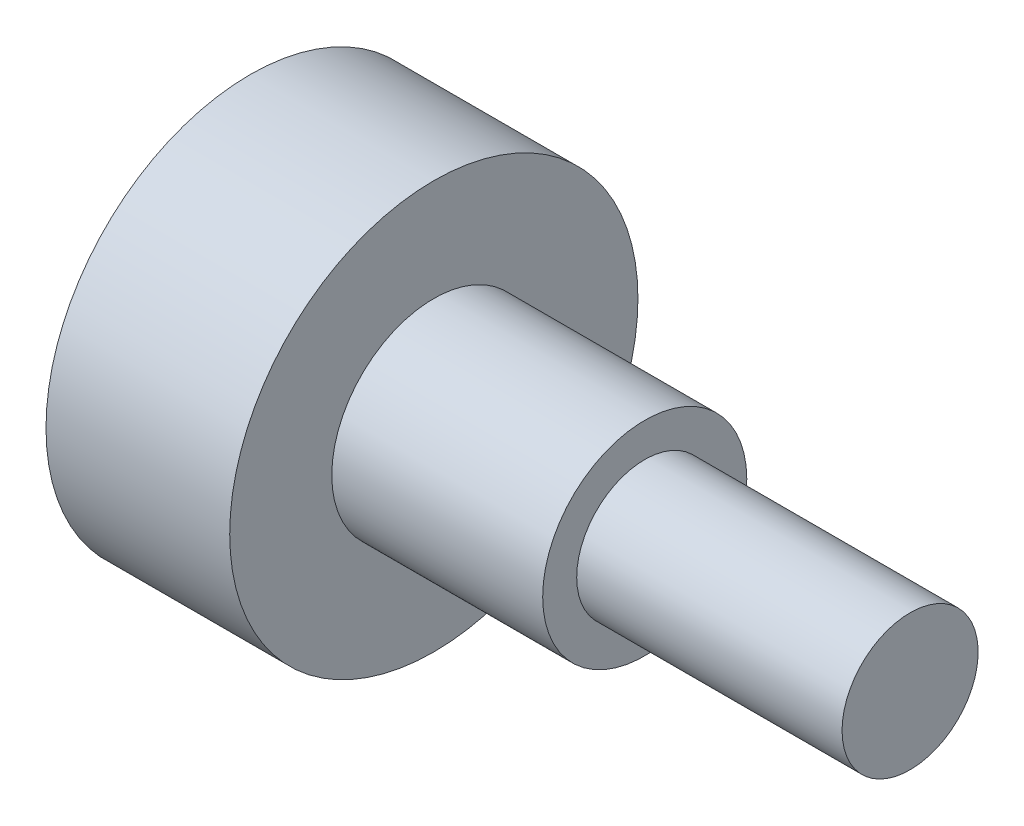
ISO-10303-21;
HEADER;
FILE_DESCRIPTION(('STEP AP214'),'2;1');
FILE_NAME('part.step','',(''),(''),'','','');
FILE_SCHEMA(('AUTOMOTIVE_DESIGN { 1 0 10303 214 1 1 1 1 }'));
ENDSEC;
DATA;
#1=APPLICATION_CONTEXT('core data for automotive mechanical design processes');
#2=APPLICATION_PROTOCOL_DEFINITION('international standard','automotive_design',2000,#1);
#3=PRODUCT_CONTEXT('',#1,'mechanical');
#4=PRODUCT('Part','Part','',(#3));
#5=PRODUCT_RELATED_PRODUCT_CATEGORY('part','',(#4));
#6=PRODUCT_DEFINITION_FORMATION('','',#4);
#7=PRODUCT_DEFINITION_CONTEXT('part definition',#1,'design');
#8=PRODUCT_DEFINITION('design','',#6,#7);
#9=PRODUCT_DEFINITION_SHAPE('','',#8);
#10=(LENGTH_UNIT() NAMED_UNIT(*) SI_UNIT(.MILLI.,.METRE.));
#11=(NAMED_UNIT(*) PLANE_ANGLE_UNIT() SI_UNIT($,.RADIAN.));
#12=(NAMED_UNIT(*) SI_UNIT($,.STERADIAN.) SOLID_ANGLE_UNIT());
#13=UNCERTAINTY_MEASURE_WITH_UNIT(LENGTH_MEASURE(1.E-05),#10,'distance_accuracy_value','');
#14=(GEOMETRIC_REPRESENTATION_CONTEXT(3) GLOBAL_UNCERTAINTY_ASSIGNED_CONTEXT((#13)) GLOBAL_UNIT_ASSIGNED_CONTEXT((#10,
#11,#12)) REPRESENTATION_CONTEXT('',''));
#15=CARTESIAN_POINT('',(0.,0.,0.));
#16=DIRECTION('',(0.,0.,1.));
#17=DIRECTION('',(1.,0.,0.));
#18=AXIS2_PLACEMENT_3D('',#15,#16,#17);
#19=CARTESIAN_POINT('',(0.,2.,0.));
#20=DIRECTION('',(-1.,0.,0.));
#21=DIRECTION('',(0.,0.,1.));
#22=AXIS2_PLACEMENT_3D('',#19,#20,#21);
#23=PLANE('',#22);
#24=CARTESIAN_POINT('',(0.,0.,0.));
#25=DIRECTION('',(-1.,0.,0.));
#26=DIRECTION('',(0.,0.,1.));
#27=AXIS2_PLACEMENT_3D('',#24,#25,#26);
#28=CIRCLE('',#27,1.5);
#29=CARTESIAN_POINT('',(0.,0.,1.5));
#30=VERTEX_POINT('',#29);
#31=EDGE_CURVE('E126',#30,#30,#28,.T.);
#32=ORIENTED_EDGE('',*,*,#31,.T.);
#33=EDGE_LOOP('',(#32));
#34=FACE_BOUND('',#33,.T.);
#35=CARTESIAN_POINT('',(0.,0.,0.));
#36=DIRECTION('',(-1.,0.,0.));
#37=DIRECTION('',(0.,0.,1.));
#38=AXIS2_PLACEMENT_3D('',#35,#36,#37);
#39=CIRCLE('',#38,3.);
#40=CARTESIAN_POINT('',(0.,0.,3.));
#41=VERTEX_POINT('',#40);
#42=EDGE_CURVE('E146',#41,#41,#39,.T.);
#43=ORIENTED_EDGE('',*,*,#42,.F.);
#44=EDGE_LOOP('',(#43));
#45=FACE_BOUND('',#44,.T.);
#46=ADVANCED_FACE('F32',(#34,#45),#23,.F.);
#47=CARTESIAN_POINT('',(-0.757628827681368,0.,0.));
#48=DIRECTION('',(-1.,0.,0.));
#49=DIRECTION('',(0.,0.,1.));
#50=AXIS2_PLACEMENT_3D('',#47,#48,#49);
#51=CYLINDRICAL_SURFACE('',#50,1.5);
#52=ORIENTED_EDGE('',*,*,#31,.F.);
#53=EDGE_LOOP('',(#52));
#54=FACE_BOUND('',#53,.T.);
#55=CARTESIAN_POINT('',(3.1,0.,0.));
#56=DIRECTION('',(-1.,0.,0.));
#57=DIRECTION('',(0.,0.,1.));
#58=AXIS2_PLACEMENT_3D('',#55,#56,#57);
#59=CIRCLE('',#58,1.5);
#60=CARTESIAN_POINT('',(3.1,0.,1.5));
#61=VERTEX_POINT('',#60);
#62=EDGE_CURVE('E91',#61,#61,#59,.T.);
#63=ORIENTED_EDGE('',*,*,#62,.T.);
#64=EDGE_LOOP('',(#63));
#65=FACE_BOUND('',#64,.T.);
#66=ADVANCED_FACE('F154',(#54,#65),#51,.T.);
#67=CARTESIAN_POINT('',(0.,0.,0.));
#68=DIRECTION('',(-1.,0.,0.));
#69=DIRECTION('',(0.,0.,1.));
#70=AXIS2_PLACEMENT_3D('',#67,#68,#69);
#71=CYLINDRICAL_SURFACE('',#70,1.);
#72=CARTESIAN_POINT('',(7.,0.,0.));
#73=DIRECTION('',(-1.,0.,0.));
#74=DIRECTION('',(0.,0.,1.));
#75=AXIS2_PLACEMENT_3D('',#72,#73,#74);
#76=CIRCLE('',#75,1.);
#77=CARTESIAN_POINT('',(7.,0.,1.));
#78=VERTEX_POINT('',#77);
#79=EDGE_CURVE('E129',#78,#78,#76,.T.);
#80=ORIENTED_EDGE('',*,*,#79,.T.);
#81=EDGE_LOOP('',(#80));
#82=FACE_BOUND('',#81,.T.);
#83=CARTESIAN_POINT('',(3.1,0.,0.));
#84=DIRECTION('',(-1.,0.,0.));
#85=DIRECTION('',(0.,0.,1.));
#86=AXIS2_PLACEMENT_3D('',#83,#84,#85);
#87=CIRCLE('',#86,0.999999999999999);
#88=CARTESIAN_POINT('',(3.1,0.,0.999999999999999));
#89=VERTEX_POINT('',#88);
#90=EDGE_CURVE('E132',#89,#89,#87,.T.);
#91=ORIENTED_EDGE('',*,*,#90,.F.);
#92=EDGE_LOOP('',(#91));
#93=FACE_BOUND('',#92,.T.);
#94=ADVANCED_FACE('F159',(#82,#93),#71,.T.);
#95=CARTESIAN_POINT('',(3.1,1.5,0.));
#96=DIRECTION('',(1.,0.,0.));
#97=DIRECTION('',(0.,0.,-1.));
#98=AXIS2_PLACEMENT_3D('',#95,#96,#97);
#99=PLANE('',#98);
#100=ORIENTED_EDGE('',*,*,#90,.T.);
#101=EDGE_LOOP('',(#100));
#102=FACE_BOUND('',#101,.T.);
#103=ORIENTED_EDGE('',*,*,#62,.F.);
#104=EDGE_LOOP('',(#103));
#105=FACE_BOUND('',#104,.T.);
#106=ADVANCED_FACE('F166',(#102,#105),#99,.T.);
#107=CARTESIAN_POINT('',(7.,0.,0.));
#108=DIRECTION('',(-1.,0.,0.));
#109=DIRECTION('',(0.,0.,1.));
#110=AXIS2_PLACEMENT_3D('',#107,#108,#109);
#111=PLANE('',#110);
#112=ORIENTED_EDGE('',*,*,#79,.F.);
#113=EDGE_LOOP('',(#112));
#114=FACE_BOUND('',#113,.T.);
#115=ADVANCED_FACE('F168',(#114),#111,.F.);
#116=CARTESIAN_POINT('',(-2.7,3.,0.));
#117=DIRECTION('',(-1.,0.,0.));
#118=DIRECTION('',(0.,0.,1.));
#119=AXIS2_PLACEMENT_3D('',#116,#117,#118);
#120=PLANE('',#119);
#121=CARTESIAN_POINT('',(-2.7,0.,0.));
#122=DIRECTION('',(-1.,0.,0.));
#123=DIRECTION('',(0.,0.,1.));
#124=AXIS2_PLACEMENT_3D('',#121,#122,#123);
#125=CIRCLE('',#124,3.);
#126=CARTESIAN_POINT('',(-2.7,0.,3.));
#127=VERTEX_POINT('',#126);
#128=EDGE_CURVE('E143',#127,#127,#125,.T.);
#129=ORIENTED_EDGE('',*,*,#128,.T.);
#130=EDGE_LOOP('',(#129));
#131=FACE_BOUND('',#130,.T.);
#132=DIRECTION('',(0.,-0.5,0.866025403784439));
#133=VECTOR('',#132,1.);
#134=CARTESIAN_POINT('',(-2.7,0.86602540378444,1.5));
#135=LINE('',#134,#133);
#136=CARTESIAN_POINT('',(-2.7,1.73205080756888,0.));
#137=VERTEX_POINT('',#136);
#138=CARTESIAN_POINT('',(-2.7,0.86602540378444,1.5));
#139=VERTEX_POINT('',#138);
#140=EDGE_CURVE('E83',#137,#139,#135,.T.);
#141=ORIENTED_EDGE('',*,*,#140,.T.);
#142=DIRECTION('',(0.,-1.,0.));
#143=VECTOR('',#142,1.);
#144=CARTESIAN_POINT('',(-2.7,-0.866025403784439,1.5));
#145=LINE('',#144,#143);
#146=CARTESIAN_POINT('',(-2.7,-0.866025403784439,1.5));
#147=VERTEX_POINT('',#146);
#148=EDGE_CURVE('E92',#139,#147,#145,.T.);
#149=ORIENTED_EDGE('',*,*,#148,.T.);
#150=DIRECTION('',(0.,-0.5,-0.866025403784438));
#151=VECTOR('',#150,1.);
#152=CARTESIAN_POINT('',(-2.7,-1.73205080756888,0.));
#153=LINE('',#152,#151);
#154=CARTESIAN_POINT('',(-2.7,-1.73205080756888,0.));
#155=VERTEX_POINT('',#154);
#156=EDGE_CURVE('E138',#147,#155,#153,.T.);
#157=ORIENTED_EDGE('',*,*,#156,.T.);
#158=DIRECTION('',(0.,0.5,-0.866025403784439));
#159=VECTOR('',#158,1.);
#160=CARTESIAN_POINT('',(-2.7,-0.866025403784439,-1.5));
#161=LINE('',#160,#159);
#162=CARTESIAN_POINT('',(-2.7,-0.866025403784439,-1.5));
#163=VERTEX_POINT('',#162);
#164=EDGE_CURVE('E140',#155,#163,#161,.T.);
#165=ORIENTED_EDGE('',*,*,#164,.T.);
#166=DIRECTION('',(0.,1.,0.));
#167=VECTOR('',#166,1.);
#168=CARTESIAN_POINT('',(-2.7,0.866025403784439,-1.5));
#169=LINE('',#168,#167);
#170=CARTESIAN_POINT('',(-2.7,0.866025403784439,-1.5));
#171=VERTEX_POINT('',#170);
#172=EDGE_CURVE('E45',#163,#171,#169,.T.);
#173=ORIENTED_EDGE('',*,*,#172,.T.);
#174=DIRECTION('',(0.,0.5,0.866025403784439));
#175=VECTOR('',#174,1.);
#176=CARTESIAN_POINT('',(-2.7,1.73205080756888,0.));
#177=LINE('',#176,#175);
#178=EDGE_CURVE('E11',#171,#137,#177,.T.);
#179=ORIENTED_EDGE('',*,*,#178,.T.);
#180=EDGE_LOOP('',(#141,#149,#157,#165,#173,#179));
#181=FACE_BOUND('',#180,.T.);
#182=ADVANCED_FACE('F82',(#131,#181),#120,.T.);
#183=CARTESIAN_POINT('',(-4.40563250720869,0.,0.));
#184=DIRECTION('',(-1.,0.,0.));
#185=DIRECTION('',(0.,0.,1.));
#186=AXIS2_PLACEMENT_3D('',#183,#184,#185);
#187=CYLINDRICAL_SURFACE('',#186,3.);
#188=ORIENTED_EDGE('',*,*,#42,.T.);
#189=EDGE_LOOP('',(#188));
#190=FACE_BOUND('',#189,.T.);
#191=ORIENTED_EDGE('',*,*,#128,.F.);
#192=EDGE_LOOP('',(#191));
#193=FACE_BOUND('',#192,.T.);
#194=ADVANCED_FACE('F150',(#190,#193),#187,.T.);
#195=CARTESIAN_POINT('',(-1.3,2.59807621135332,-1.5));
#196=DIRECTION('',(-1.,0.,0.));
#197=DIRECTION('',(0.,0.,1.));
#198=AXIS2_PLACEMENT_3D('',#195,#196,#197);
#199=PLANE('',#198);
#200=DIRECTION('',(0.,0.5,-0.866025403784439));
#201=VECTOR('',#200,1.);
#202=CARTESIAN_POINT('',(-1.3,0.86602540378444,1.5));
#203=LINE('',#202,#201);
#204=CARTESIAN_POINT('',(-1.3,0.86602540378444,1.5));
#205=VERTEX_POINT('',#204);
#206=CARTESIAN_POINT('',(-1.3,1.73205080756888,0.));
#207=VERTEX_POINT('',#206);
#208=EDGE_CURVE('E124',#205,#207,#203,.T.);
#209=ORIENTED_EDGE('',*,*,#208,.T.);
#210=DIRECTION('',(0.,-0.5,-0.866025403784439));
#211=VECTOR('',#210,1.);
#212=CARTESIAN_POINT('',(-1.3,1.73205080756888,0.));
#213=LINE('',#212,#211);
#214=CARTESIAN_POINT('',(-1.3,0.866025403784439,-1.5));
#215=VERTEX_POINT('',#214);
#216=EDGE_CURVE('E96',#207,#215,#213,.T.);
#217=ORIENTED_EDGE('',*,*,#216,.T.);
#218=DIRECTION('',(0.,-1.,0.));
#219=VECTOR('',#218,1.);
#220=CARTESIAN_POINT('',(-1.3,0.866025403784439,-1.5));
#221=LINE('',#220,#219);
#222=CARTESIAN_POINT('',(-1.3,-0.866025403784439,-1.5));
#223=VERTEX_POINT('',#222);
#224=EDGE_CURVE('E120',#215,#223,#221,.T.);
#225=ORIENTED_EDGE('',*,*,#224,.T.);
#226=DIRECTION('',(0.,-0.5,0.866025403784439));
#227=VECTOR('',#226,1.);
#228=CARTESIAN_POINT('',(-1.3,-0.866025403784439,-1.5));
#229=LINE('',#228,#227);
#230=CARTESIAN_POINT('',(-1.3,-1.73205080756888,0.));
#231=VERTEX_POINT('',#230);
#232=EDGE_CURVE('E117',#223,#231,#229,.T.);
#233=ORIENTED_EDGE('',*,*,#232,.T.);
#234=DIRECTION('',(0.,0.5,0.866025403784438));
#235=VECTOR('',#234,1.);
#236=CARTESIAN_POINT('',(-1.3,-1.73205080756888,0.));
#237=LINE('',#236,#235);
#238=CARTESIAN_POINT('',(-1.3,-0.866025403784439,1.5));
#239=VERTEX_POINT('',#238);
#240=EDGE_CURVE('E103',#231,#239,#237,.T.);
#241=ORIENTED_EDGE('',*,*,#240,.T.);
#242=DIRECTION('',(0.,1.,0.));
#243=VECTOR('',#242,1.);
#244=CARTESIAN_POINT('',(-1.3,-0.866025403784439,1.5));
#245=LINE('',#244,#243);
#246=EDGE_CURVE('E99',#239,#205,#245,.T.);
#247=ORIENTED_EDGE('',*,*,#246,.T.);
#248=EDGE_LOOP('',(#209,#217,#225,#233,#241,#247));
#249=FACE_BOUND('',#248,.T.);
#250=ADVANCED_FACE('F181',(#249),#199,.T.);
#251=CARTESIAN_POINT('',(-1.3,1.73205080756888,0.));
#252=DIRECTION('',(0.,0.866025403784439,-0.5));
#253=DIRECTION('',(0.,0.5,0.866025403784439));
#254=AXIS2_PLACEMENT_3D('',#251,#252,#253);
#255=PLANE('',#254);
#256=ORIENTED_EDGE('',*,*,#178,.F.);
#257=DIRECTION('',(-1.,0.,0.));
#258=VECTOR('',#257,1.);
#259=CARTESIAN_POINT('',(-1.3,0.866025403784439,-1.5));
#260=LINE('',#259,#258);
#261=EDGE_CURVE('E98',#215,#171,#260,.T.);
#262=ORIENTED_EDGE('',*,*,#261,.F.);
#263=ORIENTED_EDGE('',*,*,#216,.F.);
#264=DIRECTION('',(-1.,0.,0.));
#265=VECTOR('',#264,1.);
#266=CARTESIAN_POINT('',(-1.3,1.73205080756888,0.));
#267=LINE('',#266,#265);
#268=EDGE_CURVE('E89',#207,#137,#267,.T.);
#269=ORIENTED_EDGE('',*,*,#268,.T.);
#270=EDGE_LOOP('',(#256,#262,#263,#269));
#271=FACE_BOUND('',#270,.T.);
#272=ADVANCED_FACE('F94',(#271),#255,.F.);
#273=CARTESIAN_POINT('',(-1.3,0.866025403784439,-1.5));
#274=DIRECTION('',(0.,0.,-1.));
#275=DIRECTION('',(0.,1.,0.));
#276=AXIS2_PLACEMENT_3D('',#273,#274,#275);
#277=PLANE('',#276);
#278=ORIENTED_EDGE('',*,*,#172,.F.);
#279=DIRECTION('',(-1.,0.,0.));
#280=VECTOR('',#279,1.);
#281=CARTESIAN_POINT('',(-1.3,-0.866025403784439,-1.5));
#282=LINE('',#281,#280);
#283=EDGE_CURVE('E100',#223,#163,#282,.T.);
#284=ORIENTED_EDGE('',*,*,#283,.F.);
#285=ORIENTED_EDGE('',*,*,#224,.F.);
#286=ORIENTED_EDGE('',*,*,#261,.T.);
#287=EDGE_LOOP('',(#278,#284,#285,#286));
#288=FACE_BOUND('',#287,.T.);
#289=ADVANCED_FACE('F195',(#288),#277,.F.);
#290=CARTESIAN_POINT('',(-1.3,-0.866025403784439,-1.5));
#291=DIRECTION('',(0.,-0.866025403784439,-0.5));
#292=DIRECTION('',(0.,0.5,-0.866025403784439));
#293=AXIS2_PLACEMENT_3D('',#290,#291,#292);
#294=PLANE('',#293);
#295=ORIENTED_EDGE('',*,*,#164,.F.);
#296=DIRECTION('',(-1.,0.,0.));
#297=VECTOR('',#296,1.);
#298=CARTESIAN_POINT('',(-1.3,-1.73205080756888,0.));
#299=LINE('',#298,#297);
#300=EDGE_CURVE('E108',#231,#155,#299,.T.);
#301=ORIENTED_EDGE('',*,*,#300,.F.);
#302=ORIENTED_EDGE('',*,*,#232,.F.);
#303=ORIENTED_EDGE('',*,*,#283,.T.);
#304=EDGE_LOOP('',(#295,#301,#302,#303));
#305=FACE_BOUND('',#304,.T.);
#306=ADVANCED_FACE('F191',(#305),#294,.F.);
#307=CARTESIAN_POINT('',(-1.3,-1.73205080756888,0.));
#308=DIRECTION('',(0.,-0.866025403784439,0.5));
#309=DIRECTION('',(0.,-0.5,-0.866025403784438));
#310=AXIS2_PLACEMENT_3D('',#307,#308,#309);
#311=PLANE('',#310);
#312=ORIENTED_EDGE('',*,*,#156,.F.);
#313=DIRECTION('',(-1.,0.,0.));
#314=VECTOR('',#313,1.);
#315=CARTESIAN_POINT('',(-1.3,-0.866025403784439,1.5));
#316=LINE('',#315,#314);
#317=EDGE_CURVE('E111',#239,#147,#316,.T.);
#318=ORIENTED_EDGE('',*,*,#317,.F.);
#319=ORIENTED_EDGE('',*,*,#240,.F.);
#320=ORIENTED_EDGE('',*,*,#300,.T.);
#321=EDGE_LOOP('',(#312,#318,#319,#320));
#322=FACE_BOUND('',#321,.T.);
#323=ADVANCED_FACE('F188',(#322),#311,.F.);
#324=CARTESIAN_POINT('',(-1.3,-0.866025403784439,1.5));
#325=DIRECTION('',(0.,0.,1.));
#326=DIRECTION('',(0.,-1.,0.));
#327=AXIS2_PLACEMENT_3D('',#324,#325,#326);
#328=PLANE('',#327);
#329=ORIENTED_EDGE('',*,*,#148,.F.);
#330=DIRECTION('',(-1.,0.,0.));
#331=VECTOR('',#330,1.);
#332=CARTESIAN_POINT('',(-1.3,0.86602540378444,1.5));
#333=LINE('',#332,#331);
#334=EDGE_CURVE('E39',#205,#139,#333,.T.);
#335=ORIENTED_EDGE('',*,*,#334,.F.);
#336=ORIENTED_EDGE('',*,*,#246,.F.);
#337=ORIENTED_EDGE('',*,*,#317,.T.);
#338=EDGE_LOOP('',(#329,#335,#336,#337));
#339=FACE_BOUND('',#338,.T.);
#340=ADVANCED_FACE('F185',(#339),#328,.F.);
#341=CARTESIAN_POINT('',(-1.3,0.86602540378444,1.5));
#342=DIRECTION('',(0.,0.866025403784439,0.5));
#343=DIRECTION('',(0.,-0.5,0.866025403784439));
#344=AXIS2_PLACEMENT_3D('',#341,#342,#343);
#345=PLANE('',#344);
#346=ORIENTED_EDGE('',*,*,#140,.F.);
#347=ORIENTED_EDGE('',*,*,#268,.F.);
#348=ORIENTED_EDGE('',*,*,#208,.F.);
#349=ORIENTED_EDGE('',*,*,#334,.T.);
#350=EDGE_LOOP('',(#346,#347,#348,#349));
#351=FACE_BOUND('',#350,.T.);
#352=ADVANCED_FACE('F88',(#351),#345,.F.);
#353=CLOSED_SHELL('',(#46,#66,#94,#106,#115,#182,#194,#250,#272,#289,#306,#323,#340,#352));
#354=MANIFOLD_SOLID_BREP('B2',#353);
#355=ADVANCED_BREP_SHAPE_REPRESENTATION('',(#18,#354),#14);
#356=SHAPE_DEFINITION_REPRESENTATION(#9,#355);
ENDSEC;
END-ISO-10303-21;
